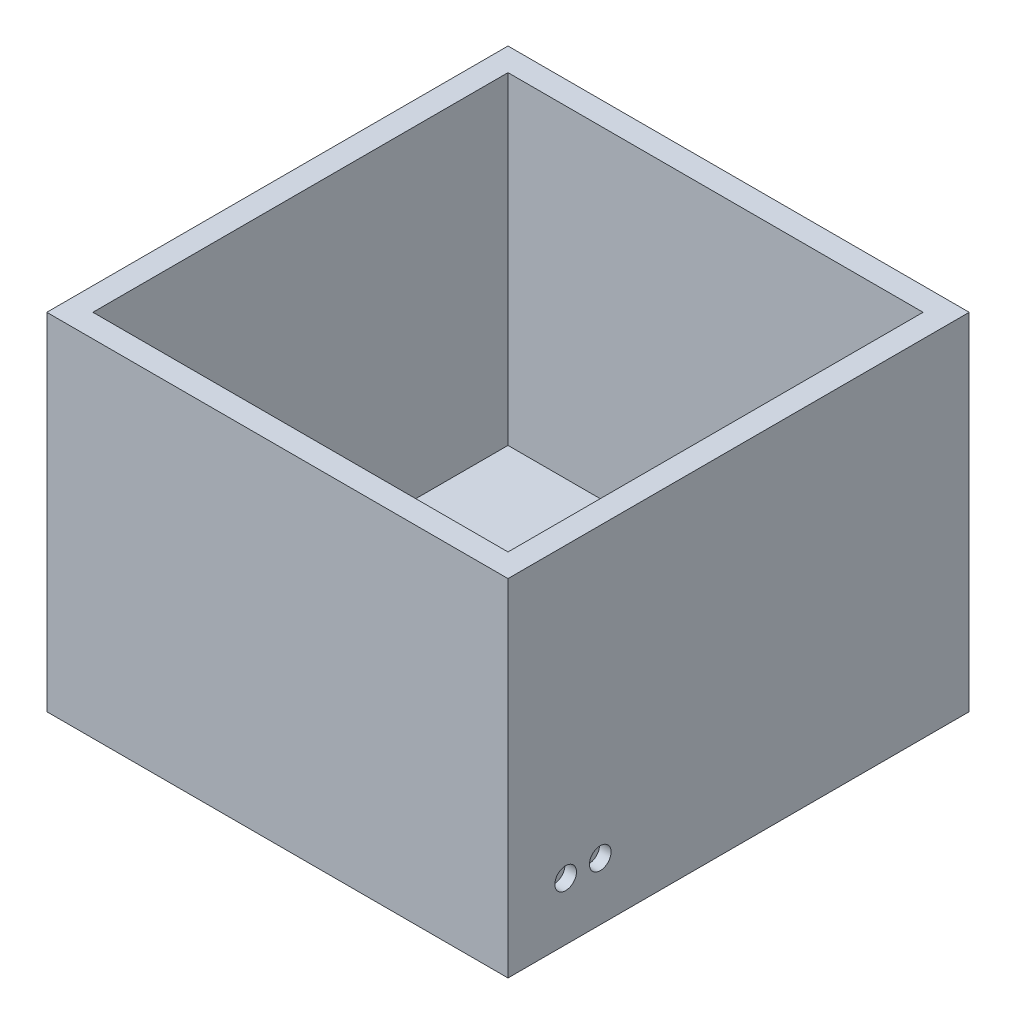
ISO-10303-21;
HEADER;
FILE_DESCRIPTION(('STEP AP214'),'2;1');
FILE_NAME('part.step','',(''),(''),'','','');
FILE_SCHEMA(('AUTOMOTIVE_DESIGN { 1 0 10303 214 1 1 1 1 }'));
ENDSEC;
DATA;
#1=APPLICATION_CONTEXT('core data for automotive mechanical design processes');
#2=APPLICATION_PROTOCOL_DEFINITION('international standard','automotive_design',2000,#1);
#3=PRODUCT_CONTEXT('',#1,'mechanical');
#4=PRODUCT('Part','Part','',(#3));
#5=PRODUCT_RELATED_PRODUCT_CATEGORY('part','',(#4));
#6=PRODUCT_DEFINITION_FORMATION('','',#4);
#7=PRODUCT_DEFINITION_CONTEXT('part definition',#1,'design');
#8=PRODUCT_DEFINITION('design','',#6,#7);
#9=PRODUCT_DEFINITION_SHAPE('','',#8);
#10=(LENGTH_UNIT() NAMED_UNIT(*) SI_UNIT(.MILLI.,.METRE.));
#11=(NAMED_UNIT(*) PLANE_ANGLE_UNIT() SI_UNIT($,.RADIAN.));
#12=(NAMED_UNIT(*) SI_UNIT($,.STERADIAN.) SOLID_ANGLE_UNIT());
#13=UNCERTAINTY_MEASURE_WITH_UNIT(LENGTH_MEASURE(1.E-05),#10,'distance_accuracy_value','');
#14=(GEOMETRIC_REPRESENTATION_CONTEXT(3) GLOBAL_UNCERTAINTY_ASSIGNED_CONTEXT((#13)) GLOBAL_UNIT_ASSIGNED_CONTEXT((#10,
#11,#12)) REPRESENTATION_CONTEXT('',''));
#15=CARTESIAN_POINT('',(0.,0.,0.));
#16=DIRECTION('',(0.,0.,1.));
#17=DIRECTION('',(1.,0.,0.));
#18=AXIS2_PLACEMENT_3D('',#15,#16,#17);
#19=CARTESIAN_POINT('',(-97.6923076923077,76.2,-58.7474012474012));
#20=DIRECTION('',(1.,0.,0.));
#21=DIRECTION('',(0.,0.,-1.));
#22=AXIS2_PLACEMENT_3D('',#19,#20,#21);
#23=PLANE('',#22);
#24=DIRECTION('',(0.,0.,1.));
#25=VECTOR('',#24,1.);
#26=CARTESIAN_POINT('',(-97.6923076923077,0.,-58.7474012474012));
#27=LINE('',#26,#25);
#28=CARTESIAN_POINT('',(-97.6923076923077,0.,-58.7474012474012));
#29=VERTEX_POINT('',#28);
#30=CARTESIAN_POINT('',(-97.6923076923077,0.,42.8525987525987));
#31=VERTEX_POINT('',#30);
#32=EDGE_CURVE('E145',#29,#31,#27,.T.);
#33=ORIENTED_EDGE('',*,*,#32,.T.);
#34=DIRECTION('',(0.,-1.,0.));
#35=VECTOR('',#34,1.);
#36=CARTESIAN_POINT('',(-97.6923076923077,76.2,42.8525987525987));
#37=LINE('',#36,#35);
#38=CARTESIAN_POINT('',(-97.6923076923077,76.2,42.8525987525987));
#39=VERTEX_POINT('',#38);
#40=EDGE_CURVE('E11',#39,#31,#37,.T.);
#41=ORIENTED_EDGE('',*,*,#40,.F.);
#42=DIRECTION('',(0.,0.,1.));
#43=VECTOR('',#42,1.);
#44=CARTESIAN_POINT('',(-97.6923076923077,76.2,-58.7474012474012));
#45=LINE('',#44,#43);
#46=CARTESIAN_POINT('',(-97.6923076923077,76.2,-58.7474012474012));
#47=VERTEX_POINT('',#46);
#48=EDGE_CURVE('E149',#47,#39,#45,.T.);
#49=ORIENTED_EDGE('',*,*,#48,.F.);
#50=DIRECTION('',(0.,-1.,0.));
#51=VECTOR('',#50,1.);
#52=CARTESIAN_POINT('',(-97.6923076923077,76.2,-58.7474012474012));
#53=LINE('',#52,#51);
#54=EDGE_CURVE('E155',#47,#29,#53,.T.);
#55=ORIENTED_EDGE('',*,*,#54,.T.);
#56=EDGE_LOOP('',(#33,#41,#49,#55));
#57=FACE_BOUND('',#56,.T.);
#58=ADVANCED_FACE('F33',(#57),#23,.F.);
#59=CARTESIAN_POINT('',(-97.6923076923077,76.2,42.8525987525987));
#60=DIRECTION('',(0.,0.,-1.));
#61=DIRECTION('',(-1.,0.,0.));
#62=AXIS2_PLACEMENT_3D('',#59,#60,#61);
#63=PLANE('',#62);
#64=DIRECTION('',(1.,0.,0.));
#65=VECTOR('',#64,1.);
#66=CARTESIAN_POINT('',(-97.6923076923077,0.,42.8525987525987));
#67=LINE('',#66,#65);
#68=CARTESIAN_POINT('',(3.90769230769228,0.,42.8525987525987));
#69=VERTEX_POINT('',#68);
#70=EDGE_CURVE('E158',#31,#69,#67,.T.);
#71=ORIENTED_EDGE('',*,*,#70,.T.);
#72=DIRECTION('',(0.,-1.,0.));
#73=VECTOR('',#72,1.);
#74=CARTESIAN_POINT('',(3.90769230769228,76.2,42.8525987525987));
#75=LINE('',#74,#73);
#76=CARTESIAN_POINT('',(3.90769230769228,76.2,42.8525987525987));
#77=VERTEX_POINT('',#76);
#78=EDGE_CURVE('E40',#77,#69,#75,.T.);
#79=ORIENTED_EDGE('',*,*,#78,.F.);
#80=DIRECTION('',(1.,0.,0.));
#81=VECTOR('',#80,1.);
#82=CARTESIAN_POINT('',(-97.6923076923077,76.2,42.8525987525987));
#83=LINE('',#82,#81);
#84=EDGE_CURVE('E84',#39,#77,#83,.T.);
#85=ORIENTED_EDGE('',*,*,#84,.F.);
#86=ORIENTED_EDGE('',*,*,#40,.T.);
#87=EDGE_LOOP('',(#71,#79,#85,#86));
#88=FACE_BOUND('',#87,.T.);
#89=ADVANCED_FACE('F187',(#88),#63,.F.);
#90=CARTESIAN_POINT('',(3.90769230769226,76.2,-58.7474012474012));
#91=DIRECTION('',(-1.,0.,0.));
#92=DIRECTION('',(0.,0.,1.));
#93=AXIS2_PLACEMENT_3D('',#90,#91,#92);
#94=PLANE('',#93);
#95=CARTESIAN_POINT('',(3.90769230769228,12.7,22.5325987525987));
#96=DIRECTION('',(1.,0.,0.));
#97=DIRECTION('',(0.,0.,-1.));
#98=AXIS2_PLACEMENT_3D('',#95,#96,#97);
#99=CIRCLE('',#98,2.38125);
#100=CARTESIAN_POINT('',(3.90769230769228,12.7,20.1513487525987));
#101=VERTEX_POINT('',#100);
#102=EDGE_CURVE('E367',#101,#101,#99,.T.);
#103=ORIENTED_EDGE('',*,*,#102,.F.);
#104=EDGE_LOOP('',(#103));
#105=FACE_BOUND('',#104,.T.);
#106=CARTESIAN_POINT('',(3.90769230769228,12.7,30.1525987525987));
#107=DIRECTION('',(1.,0.,0.));
#108=DIRECTION('',(0.,0.,-1.));
#109=AXIS2_PLACEMENT_3D('',#106,#107,#108);
#110=CIRCLE('',#109,2.38125);
#111=CARTESIAN_POINT('',(3.90769230769228,12.7,27.7713487525987));
#112=VERTEX_POINT('',#111);
#113=EDGE_CURVE('E132',#112,#112,#110,.T.);
#114=ORIENTED_EDGE('',*,*,#113,.F.);
#115=EDGE_LOOP('',(#114));
#116=FACE_BOUND('',#115,.T.);
#117=DIRECTION('',(0.,0.,-1.));
#118=VECTOR('',#117,1.);
#119=CARTESIAN_POINT('',(3.90769230769226,0.,-58.7474012474012));
#120=LINE('',#119,#118);
#121=CARTESIAN_POINT('',(3.90769230769226,0.,-58.7474012474012));
#122=VERTEX_POINT('',#121);
#123=EDGE_CURVE('E160',#69,#122,#120,.T.);
#124=ORIENTED_EDGE('',*,*,#123,.T.);
#125=DIRECTION('',(0.,-1.,0.));
#126=VECTOR('',#125,1.);
#127=CARTESIAN_POINT('',(3.90769230769226,76.2,-58.7474012474012));
#128=LINE('',#127,#126);
#129=CARTESIAN_POINT('',(3.90769230769226,76.2,-58.7474012474012));
#130=VERTEX_POINT('',#129);
#131=EDGE_CURVE('E164',#130,#122,#128,.T.);
#132=ORIENTED_EDGE('',*,*,#131,.F.);
#133=DIRECTION('',(0.,0.,-1.));
#134=VECTOR('',#133,1.);
#135=CARTESIAN_POINT('',(3.90769230769226,76.2,-58.7474012474012));
#136=LINE('',#135,#134);
#137=EDGE_CURVE('E152',#77,#130,#136,.T.);
#138=ORIENTED_EDGE('',*,*,#137,.F.);
#139=ORIENTED_EDGE('',*,*,#78,.T.);
#140=EDGE_LOOP('',(#124,#132,#138,#139));
#141=FACE_BOUND('',#140,.T.);
#142=ADVANCED_FACE('F169',(#105,#116,#141),#94,.F.);
#143=CARTESIAN_POINT('',(-97.6923076923077,76.2,-58.7474012474012));
#144=DIRECTION('',(0.,0.,1.));
#145=DIRECTION('',(1.,0.,0.));
#146=AXIS2_PLACEMENT_3D('',#143,#144,#145);
#147=PLANE('',#146);
#148=DIRECTION('',(-1.,0.,0.));
#149=VECTOR('',#148,1.);
#150=CARTESIAN_POINT('',(-97.6923076923077,0.,-58.7474012474012));
#151=LINE('',#150,#149);
#152=EDGE_CURVE('E77',#122,#29,#151,.T.);
#153=ORIENTED_EDGE('',*,*,#152,.T.);
#154=ORIENTED_EDGE('',*,*,#54,.F.);
#155=DIRECTION('',(-1.,0.,0.));
#156=VECTOR('',#155,1.);
#157=CARTESIAN_POINT('',(-97.6923076923077,76.2,-58.7474012474012));
#158=LINE('',#157,#156);
#159=EDGE_CURVE('E56',#130,#47,#158,.T.);
#160=ORIENTED_EDGE('',*,*,#159,.F.);
#161=ORIENTED_EDGE('',*,*,#131,.T.);
#162=EDGE_LOOP('',(#153,#154,#160,#161));
#163=FACE_BOUND('',#162,.T.);
#164=ADVANCED_FACE('F177',(#163),#147,.F.);
#165=CARTESIAN_POINT('',(0.,76.2,0.));
#166=DIRECTION('',(0.,1.,0.));
#167=DIRECTION('',(0.,0.,1.));
#168=AXIS2_PLACEMENT_3D('',#165,#166,#167);
#169=PLANE('',#168);
#170=DIRECTION('',(0.,0.,1.));
#171=VECTOR('',#170,1.);
#172=CARTESIAN_POINT('',(-92.6123076923077,76.2,-53.6674012474013));
#173=LINE('',#172,#171);
#174=CARTESIAN_POINT('',(-92.6123076923077,76.2,-53.6674012474013));
#175=VERTEX_POINT('',#174);
#176=CARTESIAN_POINT('',(-92.6123076923077,76.2,37.7725987525987));
#177=VERTEX_POINT('',#176);
#178=EDGE_CURVE('E47',#175,#177,#173,.T.);
#179=ORIENTED_EDGE('',*,*,#178,.F.);
#180=DIRECTION('',(-1.,0.,0.));
#181=VECTOR('',#180,1.);
#182=CARTESIAN_POINT('',(-92.6123076923077,76.2,-53.6674012474013));
#183=LINE('',#182,#181);
#184=CARTESIAN_POINT('',(-1.17230769230774,76.2,-53.6674012474013));
#185=VERTEX_POINT('',#184);
#186=EDGE_CURVE('E126',#185,#175,#183,.T.);
#187=ORIENTED_EDGE('',*,*,#186,.F.);
#188=DIRECTION('',(0.,0.,-1.));
#189=VECTOR('',#188,1.);
#190=CARTESIAN_POINT('',(-1.17230769230774,76.2,-53.6674012474013));
#191=LINE('',#190,#189);
#192=CARTESIAN_POINT('',(-1.17230769230771,76.2,37.7725987525987));
#193=VERTEX_POINT('',#192);
#194=EDGE_CURVE('E129',#193,#185,#191,.T.);
#195=ORIENTED_EDGE('',*,*,#194,.F.);
#196=DIRECTION('',(1.,0.,0.));
#197=VECTOR('',#196,1.);
#198=CARTESIAN_POINT('',(-92.6123076923077,76.2,37.7725987525987));
#199=LINE('',#198,#197);
#200=EDGE_CURVE('E138',#177,#193,#199,.T.);
#201=ORIENTED_EDGE('',*,*,#200,.F.);
#202=EDGE_LOOP('',(#179,#187,#195,#201));
#203=FACE_BOUND('',#202,.T.);
#204=ORIENTED_EDGE('',*,*,#48,.T.);
#205=ORIENTED_EDGE('',*,*,#84,.T.);
#206=ORIENTED_EDGE('',*,*,#137,.T.);
#207=ORIENTED_EDGE('',*,*,#159,.T.);
#208=EDGE_LOOP('',(#204,#205,#206,#207));
#209=FACE_BOUND('',#208,.T.);
#210=ADVANCED_FACE('F179',(#203,#209),#169,.T.);
#211=CARTESIAN_POINT('',(0.,0.,0.));
#212=DIRECTION('',(0.,1.,0.));
#213=DIRECTION('',(0.,0.,1.));
#214=AXIS2_PLACEMENT_3D('',#211,#212,#213);
#215=PLANE('',#214);
#216=ORIENTED_EDGE('',*,*,#32,.F.);
#217=ORIENTED_EDGE('',*,*,#152,.F.);
#218=ORIENTED_EDGE('',*,*,#123,.F.);
#219=ORIENTED_EDGE('',*,*,#70,.F.);
#220=EDGE_LOOP('',(#216,#217,#218,#219));
#221=FACE_BOUND('',#220,.T.);
#222=ADVANCED_FACE('F173',(#221),#215,.F.);
#223=CARTESIAN_POINT('',(-92.6123076923077,5.08000000000002,-53.6674012474013));
#224=DIRECTION('',(-1.,0.,0.));
#225=DIRECTION('',(0.,0.,1.));
#226=AXIS2_PLACEMENT_3D('',#223,#224,#225);
#227=PLANE('',#226);
#228=ORIENTED_EDGE('',*,*,#178,.T.);
#229=DIRECTION('',(0.,1.,0.));
#230=VECTOR('',#229,1.);
#231=CARTESIAN_POINT('',(-92.6123076923077,5.08000000000002,37.7725987525987));
#232=LINE('',#231,#230);
#233=CARTESIAN_POINT('',(-92.6123076923077,5.08000000000002,37.7725987525987));
#234=VERTEX_POINT('',#233);
#235=EDGE_CURVE('E104',#234,#177,#232,.T.);
#236=ORIENTED_EDGE('',*,*,#235,.F.);
#237=DIRECTION('',(0.,0.,1.));
#238=VECTOR('',#237,1.);
#239=CARTESIAN_POINT('',(-92.6123076923077,5.08000000000002,-53.6674012474013));
#240=LINE('',#239,#238);
#241=CARTESIAN_POINT('',(-92.6123076923077,5.08000000000002,-53.6674012474013));
#242=VERTEX_POINT('',#241);
#243=EDGE_CURVE('E108',#242,#234,#240,.T.);
#244=ORIENTED_EDGE('',*,*,#243,.F.);
#245=DIRECTION('',(0.,1.,0.));
#246=VECTOR('',#245,1.);
#247=CARTESIAN_POINT('',(-92.6123076923077,5.08000000000002,-53.6674012474013));
#248=LINE('',#247,#246);
#249=EDGE_CURVE('E143',#242,#175,#248,.T.);
#250=ORIENTED_EDGE('',*,*,#249,.T.);
#251=EDGE_LOOP('',(#228,#236,#244,#250));
#252=FACE_BOUND('',#251,.T.);
#253=ADVANCED_FACE('F106',(#252),#227,.F.);
#254=CARTESIAN_POINT('',(-92.6123076923077,5.08000000000002,-53.6674012474013));
#255=DIRECTION('',(0.,0.,-1.));
#256=DIRECTION('',(-1.,0.,0.));
#257=AXIS2_PLACEMENT_3D('',#254,#255,#256);
#258=PLANE('',#257);
#259=ORIENTED_EDGE('',*,*,#186,.T.);
#260=ORIENTED_EDGE('',*,*,#249,.F.);
#261=DIRECTION('',(-1.,0.,0.));
#262=VECTOR('',#261,1.);
#263=CARTESIAN_POINT('',(-92.6123076923077,5.08000000000002,-53.6674012474013));
#264=LINE('',#263,#262);
#265=CARTESIAN_POINT('',(-1.17230769230774,5.08000000000002,-53.6674012474013));
#266=VERTEX_POINT('',#265);
#267=EDGE_CURVE('E114',#266,#242,#264,.T.);
#268=ORIENTED_EDGE('',*,*,#267,.F.);
#269=DIRECTION('',(0.,1.,0.));
#270=VECTOR('',#269,1.);
#271=CARTESIAN_POINT('',(-1.17230769230774,5.08000000000002,-53.6674012474013));
#272=LINE('',#271,#270);
#273=EDGE_CURVE('E146',#266,#185,#272,.T.);
#274=ORIENTED_EDGE('',*,*,#273,.T.);
#275=EDGE_LOOP('',(#259,#260,#268,#274));
#276=FACE_BOUND('',#275,.T.);
#277=ADVANCED_FACE('F231',(#276),#258,.F.);
#278=CARTESIAN_POINT('',(-1.17230769230774,5.08000000000002,-53.6674012474013));
#279=DIRECTION('',(1.,0.,0.));
#280=DIRECTION('',(0.,0.,-1.));
#281=AXIS2_PLACEMENT_3D('',#278,#279,#280);
#282=PLANE('',#281);
#283=CARTESIAN_POINT('',(-1.17230769230772,12.843688334877,23.8224545457521));
#284=DIRECTION('',(1.,0.,0.));
#285=DIRECTION('',(0.,0.,-1.));
#286=AXIS2_PLACEMENT_3D('',#283,#284,#285);
#287=CIRCLE('',#286,0.634999999999999);
#288=CARTESIAN_POINT('',(-1.17230769230772,12.843688334877,23.1874545457521));
#289=VERTEX_POINT('',#288);
#290=EDGE_CURVE('E381',#289,#289,#287,.T.);
#291=ORIENTED_EDGE('',*,*,#290,.T.);
#292=EDGE_LOOP('',(#291));
#293=FACE_BOUND('',#292,.T.);
#294=CARTESIAN_POINT('',(-1.17230769230772,12.843688334877,21.2995436092861));
#295=DIRECTION('',(1.,0.,0.));
#296=DIRECTION('',(0.,0.,-1.));
#297=AXIS2_PLACEMENT_3D('',#294,#295,#296);
#298=CIRCLE('',#297,0.634999999999999);
#299=CARTESIAN_POINT('',(-1.17230769230772,12.843688334877,20.6645436092861));
#300=VERTEX_POINT('',#299);
#301=EDGE_CURVE('E386',#300,#300,#298,.T.);
#302=ORIENTED_EDGE('',*,*,#301,.T.);
#303=EDGE_LOOP('',(#302));
#304=FACE_BOUND('',#303,.T.);
#305=CARTESIAN_POINT('',(-1.17230769230772,12.7569240179003,31.4284423697826));
#306=DIRECTION('',(1.,0.,0.));
#307=DIRECTION('',(0.,0.,-1.));
#308=AXIS2_PLACEMENT_3D('',#305,#306,#307);
#309=CIRCLE('',#308,0.634999999999999);
#310=CARTESIAN_POINT('',(-1.17230769230772,12.7569240179003,30.7934423697826));
#311=VERTEX_POINT('',#310);
#312=EDGE_CURVE('E357',#311,#311,#309,.T.);
#313=ORIENTED_EDGE('',*,*,#312,.T.);
#314=EDGE_LOOP('',(#313));
#315=FACE_BOUND('',#314,.T.);
#316=CARTESIAN_POINT('',(-1.17230769230772,12.8594625658156,28.8884423697826));
#317=DIRECTION('',(1.,0.,0.));
#318=DIRECTION('',(0.,0.,-1.));
#319=AXIS2_PLACEMENT_3D('',#316,#317,#318);
#320=CIRCLE('',#319,0.634999999999999);
#321=CARTESIAN_POINT('',(-1.17230769230772,12.8594625658156,28.2534423697826));
#322=VERTEX_POINT('',#321);
#323=EDGE_CURVE('E364',#322,#322,#320,.T.);
#324=ORIENTED_EDGE('',*,*,#323,.T.);
#325=EDGE_LOOP('',(#324));
#326=FACE_BOUND('',#325,.T.);
#327=ORIENTED_EDGE('',*,*,#194,.T.);
#328=ORIENTED_EDGE('',*,*,#273,.F.);
#329=DIRECTION('',(0.,0.,-1.));
#330=VECTOR('',#329,1.);
#331=CARTESIAN_POINT('',(-1.17230769230774,5.08000000000002,-53.6674012474013));
#332=LINE('',#331,#330);
#333=CARTESIAN_POINT('',(-1.17230769230771,5.08000000000002,37.7725987525987));
#334=VERTEX_POINT('',#333);
#335=EDGE_CURVE('E122',#334,#266,#332,.T.);
#336=ORIENTED_EDGE('',*,*,#335,.F.);
#337=DIRECTION('',(0.,1.,0.));
#338=VECTOR('',#337,1.);
#339=CARTESIAN_POINT('',(-1.17230769230771,5.08000000000002,37.7725987525987));
#340=LINE('',#339,#338);
#341=EDGE_CURVE('E113',#334,#193,#340,.T.);
#342=ORIENTED_EDGE('',*,*,#341,.T.);
#343=EDGE_LOOP('',(#327,#328,#336,#342));
#344=FACE_BOUND('',#343,.T.);
#345=ADVANCED_FACE('F226',(#293,#304,#315,#326,#344),#282,.F.);
#346=CARTESIAN_POINT('',(-92.6123076923077,5.08000000000002,37.7725987525987));
#347=DIRECTION('',(0.,0.,1.));
#348=DIRECTION('',(1.,0.,0.));
#349=AXIS2_PLACEMENT_3D('',#346,#347,#348);
#350=PLANE('',#349);
#351=ORIENTED_EDGE('',*,*,#200,.T.);
#352=ORIENTED_EDGE('',*,*,#341,.F.);
#353=DIRECTION('',(1.,0.,0.));
#354=VECTOR('',#353,1.);
#355=CARTESIAN_POINT('',(-92.6123076923077,5.08000000000002,37.7725987525987));
#356=LINE('',#355,#354);
#357=EDGE_CURVE('E117',#234,#334,#356,.T.);
#358=ORIENTED_EDGE('',*,*,#357,.F.);
#359=ORIENTED_EDGE('',*,*,#235,.T.);
#360=EDGE_LOOP('',(#351,#352,#358,#359));
#361=FACE_BOUND('',#360,.T.);
#362=ADVANCED_FACE('F118',(#361),#350,.F.);
#363=CARTESIAN_POINT('',(0.,5.08000000000002,0.));
#364=DIRECTION('',(0.,1.,0.));
#365=DIRECTION('',(0.,0.,1.));
#366=AXIS2_PLACEMENT_3D('',#363,#364,#365);
#367=PLANE('',#366);
#368=ORIENTED_EDGE('',*,*,#243,.T.);
#369=ORIENTED_EDGE('',*,*,#357,.T.);
#370=ORIENTED_EDGE('',*,*,#335,.T.);
#371=ORIENTED_EDGE('',*,*,#267,.T.);
#372=EDGE_LOOP('',(#368,#369,#370,#371));
#373=FACE_BOUND('',#372,.T.);
#374=ADVANCED_FACE('F124',(#373),#367,.T.);
#375=CARTESIAN_POINT('',(1.36769230769228,12.7,30.1525987525987));
#376=DIRECTION('',(1.,0.,0.));
#377=DIRECTION('',(0.,0.,-1.));
#378=AXIS2_PLACEMENT_3D('',#375,#376,#377);
#379=CYLINDRICAL_SURFACE('',#378,2.38125);
#380=CARTESIAN_POINT('',(1.36769230769228,12.7,30.1525987525987));
#381=DIRECTION('',(1.,0.,0.));
#382=DIRECTION('',(0.,0.,-1.));
#383=AXIS2_PLACEMENT_3D('',#380,#381,#382);
#384=CIRCLE('',#383,2.38125);
#385=CARTESIAN_POINT('',(1.36769230769228,12.7,27.7713487525987));
#386=VERTEX_POINT('',#385);
#387=EDGE_CURVE('E139',#386,#386,#384,.T.);
#388=ORIENTED_EDGE('',*,*,#387,.F.);
#389=EDGE_LOOP('',(#388));
#390=FACE_BOUND('',#389,.T.);
#391=ORIENTED_EDGE('',*,*,#113,.T.);
#392=EDGE_LOOP('',(#391));
#393=FACE_BOUND('',#392,.T.);
#394=ADVANCED_FACE('F279',(#390,#393),#379,.F.);
#395=CARTESIAN_POINT('',(1.36769230769228,12.7,30.1525987525987));
#396=DIRECTION('',(1.,0.,0.));
#397=DIRECTION('',(0.,0.,-1.));
#398=AXIS2_PLACEMENT_3D('',#395,#396,#397);
#399=PLANE('',#398);
#400=CARTESIAN_POINT('',(1.36769230769228,12.7569240179003,31.4284423697826));
#401=DIRECTION('',(1.,0.,0.));
#402=DIRECTION('',(0.,0.,-1.));
#403=AXIS2_PLACEMENT_3D('',#400,#401,#402);
#404=CIRCLE('',#403,0.634999999999999);
#405=CARTESIAN_POINT('',(1.36769230769228,12.7569240179003,30.7934423697826));
#406=VERTEX_POINT('',#405);
#407=EDGE_CURVE('E359',#406,#406,#404,.T.);
#408=ORIENTED_EDGE('',*,*,#407,.F.);
#409=EDGE_LOOP('',(#408));
#410=FACE_BOUND('',#409,.T.);
#411=CARTESIAN_POINT('',(1.36769230769228,12.8594625658156,28.8884423697826));
#412=DIRECTION('',(1.,0.,0.));
#413=DIRECTION('',(0.,0.,-1.));
#414=AXIS2_PLACEMENT_3D('',#411,#412,#413);
#415=CIRCLE('',#414,0.634999999999999);
#416=CARTESIAN_POINT('',(1.36769230769228,12.8594625658156,28.2534423697826));
#417=VERTEX_POINT('',#416);
#418=EDGE_CURVE('E372',#417,#417,#415,.T.);
#419=ORIENTED_EDGE('',*,*,#418,.F.);
#420=EDGE_LOOP('',(#419));
#421=FACE_BOUND('',#420,.T.);
#422=ORIENTED_EDGE('',*,*,#387,.T.);
#423=EDGE_LOOP('',(#422));
#424=FACE_BOUND('',#423,.T.);
#425=ADVANCED_FACE('F275',(#410,#421,#424),#399,.T.);
#426=CARTESIAN_POINT('',(-1.17230769230772,12.8594625658156,28.8884423697826));
#427=DIRECTION('',(1.,0.,0.));
#428=DIRECTION('',(0.,0.,-1.));
#429=AXIS2_PLACEMENT_3D('',#426,#427,#428);
#430=CYLINDRICAL_SURFACE('',#429,0.634999999999999);
#431=ORIENTED_EDGE('',*,*,#323,.F.);
#432=EDGE_LOOP('',(#431));
#433=FACE_BOUND('',#432,.T.);
#434=ORIENTED_EDGE('',*,*,#418,.T.);
#435=EDGE_LOOP('',(#434));
#436=FACE_BOUND('',#435,.T.);
#437=ADVANCED_FACE('F271',(#433,#436),#430,.F.);
#438=CARTESIAN_POINT('',(-1.17230769230772,12.7569240179003,31.4284423697826));
#439=DIRECTION('',(1.,0.,0.));
#440=DIRECTION('',(0.,0.,-1.));
#441=AXIS2_PLACEMENT_3D('',#438,#439,#440);
#442=CYLINDRICAL_SURFACE('',#441,0.634999999999999);
#443=ORIENTED_EDGE('',*,*,#312,.F.);
#444=EDGE_LOOP('',(#443));
#445=FACE_BOUND('',#444,.T.);
#446=ORIENTED_EDGE('',*,*,#407,.T.);
#447=EDGE_LOOP('',(#446));
#448=FACE_BOUND('',#447,.T.);
#449=ADVANCED_FACE('F208',(#445,#448),#442,.F.);
#450=CARTESIAN_POINT('',(1.36769230769228,12.7,22.5325987525987));
#451=DIRECTION('',(1.,0.,0.));
#452=DIRECTION('',(0.,0.,-1.));
#453=AXIS2_PLACEMENT_3D('',#450,#451,#452);
#454=CYLINDRICAL_SURFACE('',#453,2.38125);
#455=CARTESIAN_POINT('',(1.36769230769228,12.7,22.5325987525987));
#456=DIRECTION('',(1.,0.,0.));
#457=DIRECTION('',(0.,0.,-1.));
#458=AXIS2_PLACEMENT_3D('',#455,#456,#457);
#459=CIRCLE('',#458,2.38125);
#460=CARTESIAN_POINT('',(1.36769230769228,12.7,20.1513487525987));
#461=VERTEX_POINT('',#460);
#462=EDGE_CURVE('E374',#461,#461,#459,.T.);
#463=ORIENTED_EDGE('',*,*,#462,.F.);
#464=EDGE_LOOP('',(#463));
#465=FACE_BOUND('',#464,.T.);
#466=ORIENTED_EDGE('',*,*,#102,.T.);
#467=EDGE_LOOP('',(#466));
#468=FACE_BOUND('',#467,.T.);
#469=ADVANCED_FACE('F213',(#465,#468),#454,.F.);
#470=CARTESIAN_POINT('',(1.36769230769228,12.7,22.5325987525987));
#471=DIRECTION('',(1.,0.,0.));
#472=DIRECTION('',(0.,0.,-1.));
#473=AXIS2_PLACEMENT_3D('',#470,#471,#472);
#474=PLANE('',#473);
#475=CARTESIAN_POINT('',(1.36769230769228,12.843688334877,23.8224545457521));
#476=DIRECTION('',(1.,0.,0.));
#477=DIRECTION('',(0.,0.,-1.));
#478=AXIS2_PLACEMENT_3D('',#475,#476,#477);
#479=CIRCLE('',#478,0.634999999999999);
#480=CARTESIAN_POINT('',(1.36769230769228,12.843688334877,23.1874545457521));
#481=VERTEX_POINT('',#480);
#482=EDGE_CURVE('E389',#481,#481,#479,.T.);
#483=ORIENTED_EDGE('',*,*,#482,.F.);
#484=EDGE_LOOP('',(#483));
#485=FACE_BOUND('',#484,.T.);
#486=CARTESIAN_POINT('',(1.36769230769228,12.843688334877,21.2995436092861));
#487=DIRECTION('',(1.,0.,0.));
#488=DIRECTION('',(0.,0.,-1.));
#489=AXIS2_PLACEMENT_3D('',#486,#487,#488);
#490=CIRCLE('',#489,0.634999999999999);
#491=CARTESIAN_POINT('',(1.36769230769228,12.843688334877,20.6645436092861));
#492=VERTEX_POINT('',#491);
#493=EDGE_CURVE('E383',#492,#492,#490,.T.);
#494=ORIENTED_EDGE('',*,*,#493,.F.);
#495=EDGE_LOOP('',(#494));
#496=FACE_BOUND('',#495,.T.);
#497=ORIENTED_EDGE('',*,*,#462,.T.);
#498=EDGE_LOOP('',(#497));
#499=FACE_BOUND('',#498,.T.);
#500=ADVANCED_FACE('F218',(#485,#496,#499),#474,.T.);
#501=CARTESIAN_POINT('',(-1.17230769230772,12.843688334877,21.2995436092861));
#502=DIRECTION('',(1.,0.,0.));
#503=DIRECTION('',(0.,0.,-1.));
#504=AXIS2_PLACEMENT_3D('',#501,#502,#503);
#505=CYLINDRICAL_SURFACE('',#504,0.634999999999999);
#506=ORIENTED_EDGE('',*,*,#301,.F.);
#507=EDGE_LOOP('',(#506));
#508=FACE_BOUND('',#507,.T.);
#509=ORIENTED_EDGE('',*,*,#493,.T.);
#510=EDGE_LOOP('',(#509));
#511=FACE_BOUND('',#510,.T.);
#512=ADVANCED_FACE('F243',(#508,#511),#505,.F.);
#513=CARTESIAN_POINT('',(-1.17230769230772,12.843688334877,23.8224545457521));
#514=DIRECTION('',(1.,0.,0.));
#515=DIRECTION('',(0.,0.,-1.));
#516=AXIS2_PLACEMENT_3D('',#513,#514,#515);
#517=CYLINDRICAL_SURFACE('',#516,0.634999999999999);
#518=ORIENTED_EDGE('',*,*,#290,.F.);
#519=EDGE_LOOP('',(#518));
#520=FACE_BOUND('',#519,.T.);
#521=ORIENTED_EDGE('',*,*,#482,.T.);
#522=EDGE_LOOP('',(#521));
#523=FACE_BOUND('',#522,.T.);
#524=ADVANCED_FACE('F253',(#520,#523),#517,.F.);
#525=CLOSED_SHELL('',(#58,#89,#142,#164,#210,#222,#253,#277,#345,#362,#374,#394,#425,#437,#449,
#469,#500,#512,#524));
#526=MANIFOLD_SOLID_BREP('B2',#525);
#527=ADVANCED_BREP_SHAPE_REPRESENTATION('',(#18,#526),#14);
#528=SHAPE_DEFINITION_REPRESENTATION(#9,#527);
ENDSEC;
END-ISO-10303-21;
